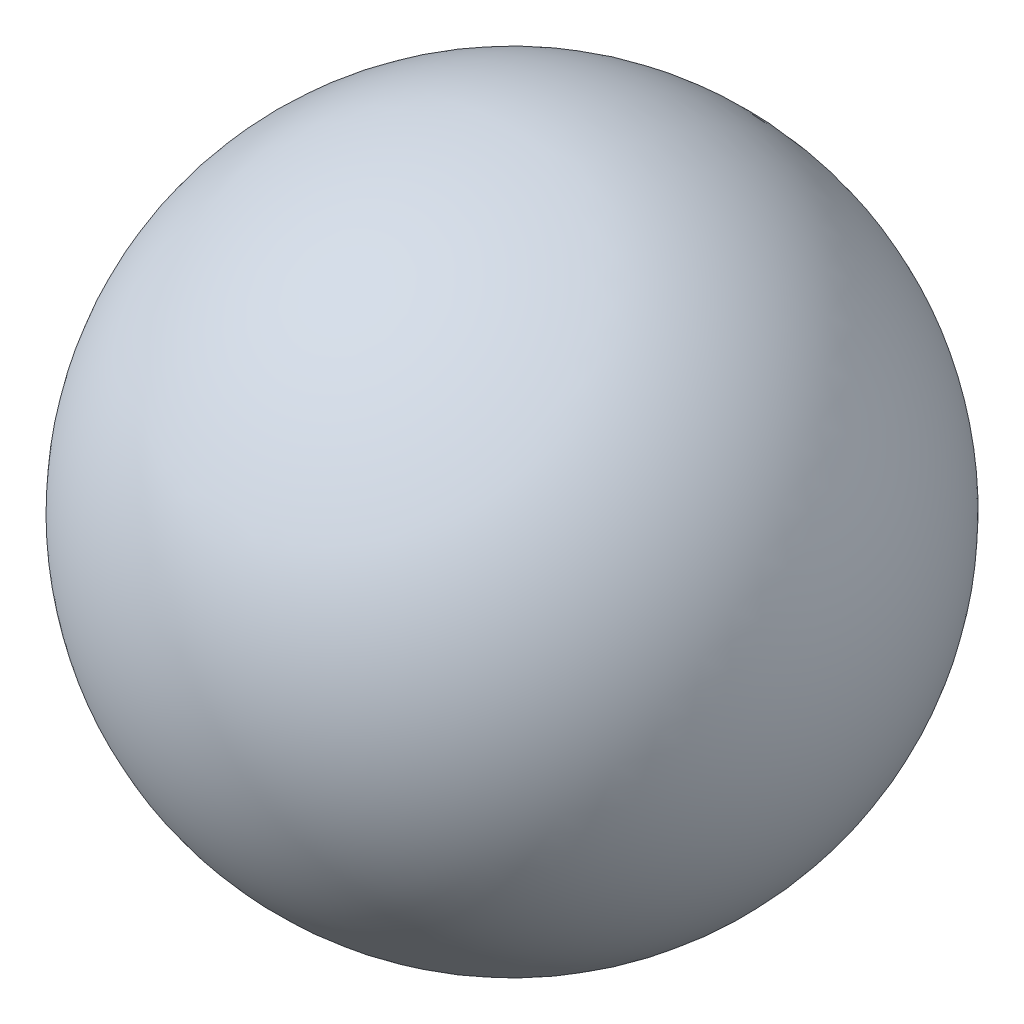
ISO-10303-21;
HEADER;
FILE_DESCRIPTION(('STEP AP214'),'2;1');
FILE_NAME('part.step','',(''),(''),'','','');
FILE_SCHEMA(('AUTOMOTIVE_DESIGN { 1 0 10303 214 1 1 1 1 }'));
ENDSEC;
DATA;
#1=APPLICATION_CONTEXT('core data for automotive mechanical design processes');
#2=APPLICATION_PROTOCOL_DEFINITION('international standard','automotive_design',2000,#1);
#3=PRODUCT_CONTEXT('',#1,'mechanical');
#4=PRODUCT('Part','Part','',(#3));
#5=PRODUCT_RELATED_PRODUCT_CATEGORY('part','',(#4));
#6=PRODUCT_DEFINITION_FORMATION('','',#4);
#7=PRODUCT_DEFINITION_CONTEXT('part definition',#1,'design');
#8=PRODUCT_DEFINITION('design','',#6,#7);
#9=PRODUCT_DEFINITION_SHAPE('','',#8);
#10=(LENGTH_UNIT() NAMED_UNIT(*) SI_UNIT(.MILLI.,.METRE.));
#11=(NAMED_UNIT(*) PLANE_ANGLE_UNIT() SI_UNIT($,.RADIAN.));
#12=(NAMED_UNIT(*) SI_UNIT($,.STERADIAN.) SOLID_ANGLE_UNIT());
#13=UNCERTAINTY_MEASURE_WITH_UNIT(LENGTH_MEASURE(1.E-05),#10,'distance_accuracy_value','');
#14=(GEOMETRIC_REPRESENTATION_CONTEXT(3) GLOBAL_UNCERTAINTY_ASSIGNED_CONTEXT((#13)) GLOBAL_UNIT_ASSIGNED_CONTEXT((#10,
#11,#12)) REPRESENTATION_CONTEXT('',''));
#15=CARTESIAN_POINT('',(0.,0.,0.));
#16=DIRECTION('',(0.,0.,1.));
#17=DIRECTION('',(1.,0.,0.));
#18=AXIS2_PLACEMENT_3D('',#15,#16,#17);
#19=CARTESIAN_POINT('',(57.535,-16.0833229056439,-59.3923582337222));
#20=DIRECTION('',(0.,-0.261383566232645,-0.965235013508889));
#21=DIRECTION('',(0.173648177666933,0.950570924782396,-0.257412562535889));
#22=AXIS2_PLACEMENT_3D('',#19,#20,#21);
#23=SPHERICAL_SURFACE('',#22,6.75);
#24=CARTESIAN_POINT('',(57.535,-17.8476619777143,-65.9076945749072));
#25=VERTEX_POINT('',#24);
#26=VERTEX_LOOP('',#25);
#27=FACE_BOUND('',#26,.T.);
#28=CARTESIAN_POINT('',(57.535,-14.3189838335735,-52.8770218925372));
#29=VERTEX_POINT('',#28);
#30=VERTEX_LOOP('',#29);
#31=FACE_BOUND('',#30,.T.);
#32=ADVANCED_FACE('F16',(#27,#31),#23,.T.);
#33=CLOSED_SHELL('',(#32));
#34=MANIFOLD_SOLID_BREP('B1',#33);
#35=ADVANCED_BREP_SHAPE_REPRESENTATION('',(#18,#34),#14);
#36=SHAPE_DEFINITION_REPRESENTATION(#9,#35);
ENDSEC;
END-ISO-10303-21;
